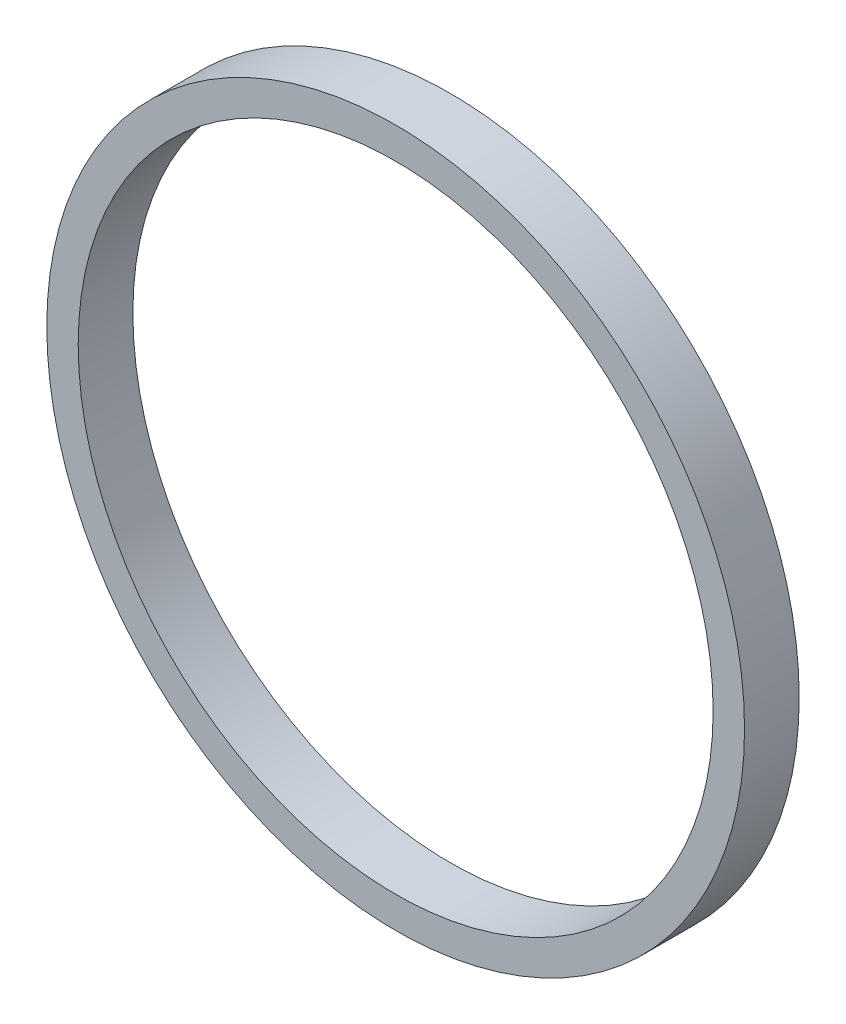
ISO-10303-21;
HEADER;
FILE_DESCRIPTION(('STEP AP214'),'2;1');
FILE_NAME('part.step','',(''),(''),'','','');
FILE_SCHEMA(('AUTOMOTIVE_DESIGN { 1 0 10303 214 1 1 1 1 }'));
ENDSEC;
DATA;
#1=APPLICATION_CONTEXT('core data for automotive mechanical design processes');
#2=APPLICATION_PROTOCOL_DEFINITION('international standard','automotive_design',2000,#1);
#3=PRODUCT_CONTEXT('',#1,'mechanical');
#4=PRODUCT('Part','Part','',(#3));
#5=PRODUCT_RELATED_PRODUCT_CATEGORY('part','',(#4));
#6=PRODUCT_DEFINITION_FORMATION('','',#4);
#7=PRODUCT_DEFINITION_CONTEXT('part definition',#1,'design');
#8=PRODUCT_DEFINITION('design','',#6,#7);
#9=PRODUCT_DEFINITION_SHAPE('','',#8);
#10=(LENGTH_UNIT() NAMED_UNIT(*) SI_UNIT(.MILLI.,.METRE.));
#11=(NAMED_UNIT(*) PLANE_ANGLE_UNIT() SI_UNIT($,.RADIAN.));
#12=(NAMED_UNIT(*) SI_UNIT($,.STERADIAN.) SOLID_ANGLE_UNIT());
#13=UNCERTAINTY_MEASURE_WITH_UNIT(LENGTH_MEASURE(1.E-05),#10,'distance_accuracy_value','');
#14=(GEOMETRIC_REPRESENTATION_CONTEXT(3) GLOBAL_UNCERTAINTY_ASSIGNED_CONTEXT((#13)) GLOBAL_UNIT_ASSIGNED_CONTEXT((#10,
#11,#12)) REPRESENTATION_CONTEXT('',''));
#15=CARTESIAN_POINT('',(0.,0.,0.));
#16=DIRECTION('',(0.,0.,1.));
#17=DIRECTION('',(1.,0.,0.));
#18=AXIS2_PLACEMENT_3D('',#15,#16,#17);
#19=CARTESIAN_POINT('',(16.,16.,9.68));
#20=DIRECTION('',(0.,0.,-1.));
#21=DIRECTION('',(-1.,0.,0.));
#22=AXIS2_PLACEMENT_3D('',#19,#20,#21);
#23=CYLINDRICAL_SURFACE('',#22,7.3756142);
#24=CARTESIAN_POINT('',(16.,16.,10.95));
#25=DIRECTION('',(0.,0.,-1.));
#26=DIRECTION('',(-1.,0.,0.));
#27=AXIS2_PLACEMENT_3D('',#24,#25,#26);
#28=CIRCLE('',#27,7.3756142);
#29=CARTESIAN_POINT('',(8.6243858,16.,10.95));
#30=VERTEX_POINT('',#29);
#31=EDGE_CURVE('E27',#30,#30,#28,.T.);
#32=ORIENTED_EDGE('',*,*,#31,.F.);
#33=EDGE_LOOP('',(#32));
#34=FACE_BOUND('',#33,.T.);
#35=CARTESIAN_POINT('',(16.,16.,9.68));
#36=DIRECTION('',(0.,0.,-1.));
#37=DIRECTION('',(-1.,0.,0.));
#38=AXIS2_PLACEMENT_3D('',#35,#36,#37);
#39=CIRCLE('',#38,7.3756142);
#40=CARTESIAN_POINT('',(8.6243858,16.,9.68));
#41=VERTEX_POINT('',#40);
#42=EDGE_CURVE('E18',#41,#41,#39,.T.);
#43=ORIENTED_EDGE('',*,*,#42,.T.);
#44=EDGE_LOOP('',(#43));
#45=FACE_BOUND('',#44,.T.);
#46=ADVANCED_FACE('F15',(#34,#45),#23,.F.);
#47=CARTESIAN_POINT('',(28.00000000001,16.000000000005,9.68));
#48=DIRECTION('',(0.,0.,1.));
#49=DIRECTION('',(1.,0.,0.));
#50=AXIS2_PLACEMENT_3D('',#47,#48,#49);
#51=PLANE('',#50);
#52=CARTESIAN_POINT('',(16.,16.,9.68));
#53=DIRECTION('',(0.,0.,-1.));
#54=DIRECTION('',(-1.,0.,0.));
#55=AXIS2_PLACEMENT_3D('',#52,#53,#54);
#56=CIRCLE('',#55,8.1051856);
#57=CARTESIAN_POINT('',(7.8948144,16.,9.68));
#58=VERTEX_POINT('',#57);
#59=EDGE_CURVE('E22',#58,#58,#56,.F.);
#60=ORIENTED_EDGE('',*,*,#59,.F.);
#61=EDGE_LOOP('',(#60));
#62=FACE_BOUND('',#61,.T.);
#63=ORIENTED_EDGE('',*,*,#42,.F.);
#64=EDGE_LOOP('',(#63));
#65=FACE_BOUND('',#64,.T.);
#66=ADVANCED_FACE('F36',(#62,#65),#51,.F.);
#67=CARTESIAN_POINT('',(28.00000000001,16.000000000005,10.95));
#68=DIRECTION('',(0.,0.,1.));
#69=DIRECTION('',(1.,0.,0.));
#70=AXIS2_PLACEMENT_3D('',#67,#68,#69);
#71=PLANE('',#70);
#72=CARTESIAN_POINT('',(16.,16.,10.95));
#73=DIRECTION('',(0.,0.,-1.));
#74=DIRECTION('',(-1.,0.,0.));
#75=AXIS2_PLACEMENT_3D('',#72,#73,#74);
#76=CIRCLE('',#75,8.1051856);
#77=CARTESIAN_POINT('',(7.8948144,16.,10.95));
#78=VERTEX_POINT('',#77);
#79=EDGE_CURVE('E10',#78,#78,#76,.T.);
#80=ORIENTED_EDGE('',*,*,#79,.F.);
#81=EDGE_LOOP('',(#80));
#82=FACE_BOUND('',#81,.T.);
#83=ORIENTED_EDGE('',*,*,#31,.T.);
#84=EDGE_LOOP('',(#83));
#85=FACE_BOUND('',#84,.T.);
#86=ADVANCED_FACE('F38',(#82,#85),#71,.T.);
#87=CARTESIAN_POINT('',(16.,16.,9.68));
#88=DIRECTION('',(0.,0.,-1.));
#89=DIRECTION('',(-1.,0.,0.));
#90=AXIS2_PLACEMENT_3D('',#87,#88,#89);
#91=CYLINDRICAL_SURFACE('',#90,8.1051856);
#92=ORIENTED_EDGE('',*,*,#79,.T.);
#93=EDGE_LOOP('',(#92));
#94=FACE_BOUND('',#93,.T.);
#95=ORIENTED_EDGE('',*,*,#59,.T.);
#96=EDGE_LOOP('',(#95));
#97=FACE_BOUND('',#96,.T.);
#98=ADVANCED_FACE('F45',(#94,#97),#91,.T.);
#99=CLOSED_SHELL('',(#46,#66,#86,#98));
#100=MANIFOLD_SOLID_BREP('B1',#99);
#101=ADVANCED_BREP_SHAPE_REPRESENTATION('',(#18,#100),#14);
#102=SHAPE_DEFINITION_REPRESENTATION(#9,#101);
ENDSEC;
END-ISO-10303-21;
